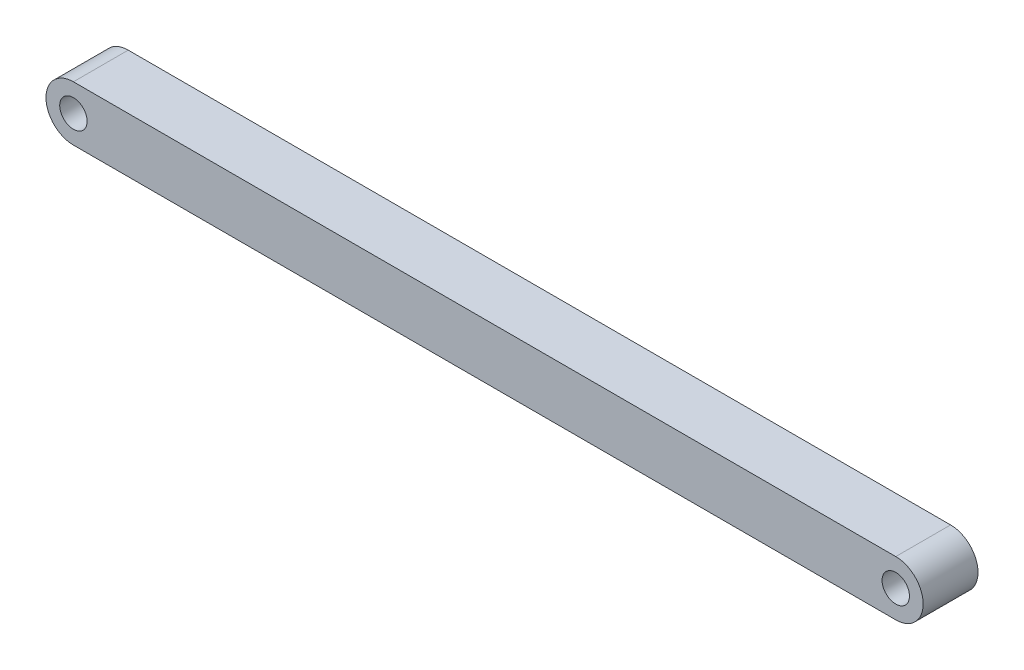
ISO-10303-21;
HEADER;
FILE_DESCRIPTION(('STEP AP214'),'2;1');
FILE_NAME('part.step','',(''),(''),'','','');
FILE_SCHEMA(('AUTOMOTIVE_DESIGN { 1 0 10303 214 1 1 1 1 }'));
ENDSEC;
DATA;
#1=APPLICATION_CONTEXT('core data for automotive mechanical design processes');
#2=APPLICATION_PROTOCOL_DEFINITION('international standard','automotive_design',2000,#1);
#3=PRODUCT_CONTEXT('',#1,'mechanical');
#4=PRODUCT('Part','Part','',(#3));
#5=PRODUCT_RELATED_PRODUCT_CATEGORY('part','',(#4));
#6=PRODUCT_DEFINITION_FORMATION('','',#4);
#7=PRODUCT_DEFINITION_CONTEXT('part definition',#1,'design');
#8=PRODUCT_DEFINITION('design','',#6,#7);
#9=PRODUCT_DEFINITION_SHAPE('','',#8);
#10=(LENGTH_UNIT() NAMED_UNIT(*) SI_UNIT(.MILLI.,.METRE.));
#11=(NAMED_UNIT(*) PLANE_ANGLE_UNIT() SI_UNIT($,.RADIAN.));
#12=(NAMED_UNIT(*) SI_UNIT($,.STERADIAN.) SOLID_ANGLE_UNIT());
#13=UNCERTAINTY_MEASURE_WITH_UNIT(LENGTH_MEASURE(1.E-05),#10,'distance_accuracy_value','');
#14=(GEOMETRIC_REPRESENTATION_CONTEXT(3) GLOBAL_UNCERTAINTY_ASSIGNED_CONTEXT((#13)) GLOBAL_UNIT_ASSIGNED_CONTEXT((#10,
#11,#12)) REPRESENTATION_CONTEXT('',''));
#15=CARTESIAN_POINT('',(0.,0.,0.));
#16=DIRECTION('',(0.,0.,1.));
#17=DIRECTION('',(1.,0.,0.));
#18=AXIS2_PLACEMENT_3D('',#15,#16,#17);
#19=CARTESIAN_POINT('',(0.,0.,5.));
#20=DIRECTION('',(0.,0.,1.));
#21=DIRECTION('',(1.,0.,0.));
#22=AXIS2_PLACEMENT_3D('',#19,#20,#21);
#23=PLANE('',#22);
#24=CARTESIAN_POINT('',(0.,0.,5.));
#25=DIRECTION('',(0.,0.,1.));
#26=DIRECTION('',(1.,0.,0.));
#27=AXIS2_PLACEMENT_3D('',#24,#25,#26);
#28=CIRCLE('',#27,2.5);
#29=CARTESIAN_POINT('',(2.5,0.,5.));
#30=VERTEX_POINT('',#29);
#31=EDGE_CURVE('E106',#30,#30,#28,.T.);
#32=ORIENTED_EDGE('',*,*,#31,.F.);
#33=EDGE_LOOP('',(#32));
#34=FACE_BOUND('',#33,.T.);
#35=CARTESIAN_POINT('',(0.,0.,5.));
#36=DIRECTION('',(0.,0.,1.));
#37=DIRECTION('',(1.,0.,0.));
#38=AXIS2_PLACEMENT_3D('',#35,#36,#37);
#39=CIRCLE('',#38,5.);
#40=CARTESIAN_POINT('',(0.,5.,5.));
#41=VERTEX_POINT('',#40);
#42=CARTESIAN_POINT('',(0.,-5.,5.));
#43=VERTEX_POINT('',#42);
#44=EDGE_CURVE('E91',#41,#43,#39,.T.);
#45=ORIENTED_EDGE('',*,*,#44,.T.);
#46=DIRECTION('',(1.,0.,0.));
#47=VECTOR('',#46,1.);
#48=CARTESIAN_POINT('',(0.,-5.,5.));
#49=LINE('',#48,#47);
#50=CARTESIAN_POINT('',(150.,-5.,5.));
#51=VERTEX_POINT('',#50);
#52=EDGE_CURVE('E86',#43,#51,#49,.T.);
#53=ORIENTED_EDGE('',*,*,#52,.T.);
#54=CARTESIAN_POINT('',(150.,0.,5.));
#55=DIRECTION('',(0.,0.,1.));
#56=DIRECTION('',(1.,0.,0.));
#57=AXIS2_PLACEMENT_3D('',#54,#55,#56);
#58=CIRCLE('',#57,5.);
#59=CARTESIAN_POINT('',(150.,5.,5.));
#60=VERTEX_POINT('',#59);
#61=EDGE_CURVE('E89',#51,#60,#58,.T.);
#62=ORIENTED_EDGE('',*,*,#61,.T.);
#63=DIRECTION('',(-1.,0.,0.));
#64=VECTOR('',#63,1.);
#65=CARTESIAN_POINT('',(0.,5.,5.));
#66=LINE('',#65,#64);
#67=EDGE_CURVE('E56',#60,#41,#66,.T.);
#68=ORIENTED_EDGE('',*,*,#67,.T.);
#69=EDGE_LOOP('',(#45,#53,#62,#68));
#70=FACE_BOUND('',#69,.T.);
#71=CARTESIAN_POINT('',(150.,0.,5.));
#72=DIRECTION('',(0.,0.,1.));
#73=DIRECTION('',(1.,0.,0.));
#74=AXIS2_PLACEMENT_3D('',#71,#72,#73);
#75=CIRCLE('',#74,2.5);
#76=CARTESIAN_POINT('',(152.5,0.,5.));
#77=VERTEX_POINT('',#76);
#78=EDGE_CURVE('E121',#77,#77,#75,.T.);
#79=ORIENTED_EDGE('',*,*,#78,.F.);
#80=EDGE_LOOP('',(#79));
#81=FACE_BOUND('',#80,.T.);
#82=ADVANCED_FACE('F39',(#34,#70,#81),#23,.T.);
#83=CARTESIAN_POINT('',(0.,0.,-5.));
#84=DIRECTION('',(0.,0.,1.));
#85=DIRECTION('',(1.,0.,0.));
#86=AXIS2_PLACEMENT_3D('',#83,#84,#85);
#87=PLANE('',#86);
#88=CARTESIAN_POINT('',(0.,0.,-5.));
#89=DIRECTION('',(0.,0.,1.));
#90=DIRECTION('',(1.,0.,0.));
#91=AXIS2_PLACEMENT_3D('',#88,#89,#90);
#92=CIRCLE('',#91,5.);
#93=CARTESIAN_POINT('',(0.,5.,-5.));
#94=VERTEX_POINT('',#93);
#95=CARTESIAN_POINT('',(0.,-5.,-5.));
#96=VERTEX_POINT('',#95);
#97=EDGE_CURVE('E103',#94,#96,#92,.T.);
#98=ORIENTED_EDGE('',*,*,#97,.F.);
#99=DIRECTION('',(-1.,0.,0.));
#100=VECTOR('',#99,1.);
#101=CARTESIAN_POINT('',(0.,5.,-5.));
#102=LINE('',#101,#100);
#103=CARTESIAN_POINT('',(150.,5.,-5.));
#104=VERTEX_POINT('',#103);
#105=EDGE_CURVE('E79',#104,#94,#102,.T.);
#106=ORIENTED_EDGE('',*,*,#105,.F.);
#107=CARTESIAN_POINT('',(150.,0.,-5.));
#108=DIRECTION('',(0.,0.,1.));
#109=DIRECTION('',(1.,0.,0.));
#110=AXIS2_PLACEMENT_3D('',#107,#108,#109);
#111=CIRCLE('',#110,5.);
#112=CARTESIAN_POINT('',(150.,-5.,-5.));
#113=VERTEX_POINT('',#112);
#114=EDGE_CURVE('E73',#113,#104,#111,.T.);
#115=ORIENTED_EDGE('',*,*,#114,.F.);
#116=DIRECTION('',(1.,0.,0.));
#117=VECTOR('',#116,1.);
#118=CARTESIAN_POINT('',(0.,-5.,-5.));
#119=LINE('',#118,#117);
#120=EDGE_CURVE('E95',#96,#113,#119,.T.);
#121=ORIENTED_EDGE('',*,*,#120,.F.);
#122=EDGE_LOOP('',(#98,#106,#115,#121));
#123=FACE_BOUND('',#122,.T.);
#124=CARTESIAN_POINT('',(0.,0.,-5.));
#125=DIRECTION('',(0.,0.,1.));
#126=DIRECTION('',(1.,0.,0.));
#127=AXIS2_PLACEMENT_3D('',#124,#125,#126);
#128=CIRCLE('',#127,2.5);
#129=CARTESIAN_POINT('',(2.5,0.,-5.));
#130=VERTEX_POINT('',#129);
#131=EDGE_CURVE('E118',#130,#130,#128,.T.);
#132=ORIENTED_EDGE('',*,*,#131,.T.);
#133=EDGE_LOOP('',(#132));
#134=FACE_BOUND('',#133,.T.);
#135=CARTESIAN_POINT('',(150.,0.,-5.));
#136=DIRECTION('',(0.,0.,1.));
#137=DIRECTION('',(1.,0.,0.));
#138=AXIS2_PLACEMENT_3D('',#135,#136,#137);
#139=CIRCLE('',#138,2.5);
#140=CARTESIAN_POINT('',(152.5,0.,-5.));
#141=VERTEX_POINT('',#140);
#142=EDGE_CURVE('E124',#141,#141,#139,.T.);
#143=ORIENTED_EDGE('',*,*,#142,.T.);
#144=EDGE_LOOP('',(#143));
#145=FACE_BOUND('',#144,.T.);
#146=ADVANCED_FACE('F114',(#123,#134,#145),#87,.F.);
#147=CARTESIAN_POINT('',(0.,0.,5.));
#148=DIRECTION('',(0.,0.,-1.));
#149=DIRECTION('',(-1.,0.,0.));
#150=AXIS2_PLACEMENT_3D('',#147,#148,#149);
#151=CYLINDRICAL_SURFACE('',#150,5.);
#152=ORIENTED_EDGE('',*,*,#97,.T.);
#153=DIRECTION('',(0.,0.,-1.));
#154=VECTOR('',#153,1.);
#155=CARTESIAN_POINT('',(0.,-5.,5.));
#156=LINE('',#155,#154);
#157=EDGE_CURVE('E11',#43,#96,#156,.T.);
#158=ORIENTED_EDGE('',*,*,#157,.F.);
#159=ORIENTED_EDGE('',*,*,#44,.F.);
#160=DIRECTION('',(0.,0.,-1.));
#161=VECTOR('',#160,1.);
#162=CARTESIAN_POINT('',(0.,5.,5.));
#163=LINE('',#162,#161);
#164=EDGE_CURVE('E99',#41,#94,#163,.T.);
#165=ORIENTED_EDGE('',*,*,#164,.T.);
#166=EDGE_LOOP('',(#152,#158,#159,#165));
#167=FACE_BOUND('',#166,.T.);
#168=ADVANCED_FACE('F41',(#167),#151,.T.);
#169=CARTESIAN_POINT('',(0.,-5.,5.));
#170=DIRECTION('',(0.,1.,0.));
#171=DIRECTION('',(0.,0.,1.));
#172=AXIS2_PLACEMENT_3D('',#169,#170,#171);
#173=PLANE('',#172);
#174=ORIENTED_EDGE('',*,*,#120,.T.);
#175=DIRECTION('',(0.,0.,-1.));
#176=VECTOR('',#175,1.);
#177=CARTESIAN_POINT('',(150.,-5.,5.));
#178=LINE('',#177,#176);
#179=EDGE_CURVE('E48',#51,#113,#178,.T.);
#180=ORIENTED_EDGE('',*,*,#179,.F.);
#181=ORIENTED_EDGE('',*,*,#52,.F.);
#182=ORIENTED_EDGE('',*,*,#157,.T.);
#183=EDGE_LOOP('',(#174,#180,#181,#182));
#184=FACE_BOUND('',#183,.T.);
#185=ADVANCED_FACE('F94',(#184),#173,.F.);
#186=CARTESIAN_POINT('',(150.,0.,5.));
#187=DIRECTION('',(0.,0.,-1.));
#188=DIRECTION('',(-1.,0.,0.));
#189=AXIS2_PLACEMENT_3D('',#186,#187,#188);
#190=CYLINDRICAL_SURFACE('',#189,5.);
#191=ORIENTED_EDGE('',*,*,#114,.T.);
#192=DIRECTION('',(0.,0.,-1.));
#193=VECTOR('',#192,1.);
#194=CARTESIAN_POINT('',(150.,5.,5.));
#195=LINE('',#194,#193);
#196=EDGE_CURVE('E96',#60,#104,#195,.T.);
#197=ORIENTED_EDGE('',*,*,#196,.F.);
#198=ORIENTED_EDGE('',*,*,#61,.F.);
#199=ORIENTED_EDGE('',*,*,#179,.T.);
#200=EDGE_LOOP('',(#191,#197,#198,#199));
#201=FACE_BOUND('',#200,.T.);
#202=ADVANCED_FACE('F97',(#201),#190,.T.);
#203=CARTESIAN_POINT('',(0.,5.,5.));
#204=DIRECTION('',(0.,-1.,0.));
#205=DIRECTION('',(0.,0.,-1.));
#206=AXIS2_PLACEMENT_3D('',#203,#204,#205);
#207=PLANE('',#206);
#208=ORIENTED_EDGE('',*,*,#105,.T.);
#209=ORIENTED_EDGE('',*,*,#164,.F.);
#210=ORIENTED_EDGE('',*,*,#67,.F.);
#211=ORIENTED_EDGE('',*,*,#196,.T.);
#212=EDGE_LOOP('',(#208,#209,#210,#211));
#213=FACE_BOUND('',#212,.T.);
#214=ADVANCED_FACE('F111',(#213),#207,.F.);
#215=CARTESIAN_POINT('',(0.,0.,5.));
#216=DIRECTION('',(0.,0.,-1.));
#217=DIRECTION('',(-1.,0.,0.));
#218=AXIS2_PLACEMENT_3D('',#215,#216,#217);
#219=CYLINDRICAL_SURFACE('',#218,2.5);
#220=ORIENTED_EDGE('',*,*,#31,.T.);
#221=EDGE_LOOP('',(#220));
#222=FACE_BOUND('',#221,.T.);
#223=ORIENTED_EDGE('',*,*,#131,.F.);
#224=EDGE_LOOP('',(#223));
#225=FACE_BOUND('',#224,.T.);
#226=ADVANCED_FACE('F141',(#222,#225),#219,.F.);
#227=CARTESIAN_POINT('',(150.,0.,5.));
#228=DIRECTION('',(0.,0.,-1.));
#229=DIRECTION('',(-1.,0.,0.));
#230=AXIS2_PLACEMENT_3D('',#227,#228,#229);
#231=CYLINDRICAL_SURFACE('',#230,2.5);
#232=ORIENTED_EDGE('',*,*,#78,.T.);
#233=EDGE_LOOP('',(#232));
#234=FACE_BOUND('',#233,.T.);
#235=ORIENTED_EDGE('',*,*,#142,.F.);
#236=EDGE_LOOP('',(#235));
#237=FACE_BOUND('',#236,.T.);
#238=ADVANCED_FACE('F130',(#234,#237),#231,.F.);
#239=CLOSED_SHELL('',(#82,#146,#168,#185,#202,#214,#226,#238));
#240=MANIFOLD_SOLID_BREP('B2',#239);
#241=ADVANCED_BREP_SHAPE_REPRESENTATION('',(#18,#240),#14);
#242=SHAPE_DEFINITION_REPRESENTATION(#9,#241);
ENDSEC;
END-ISO-10303-21;
